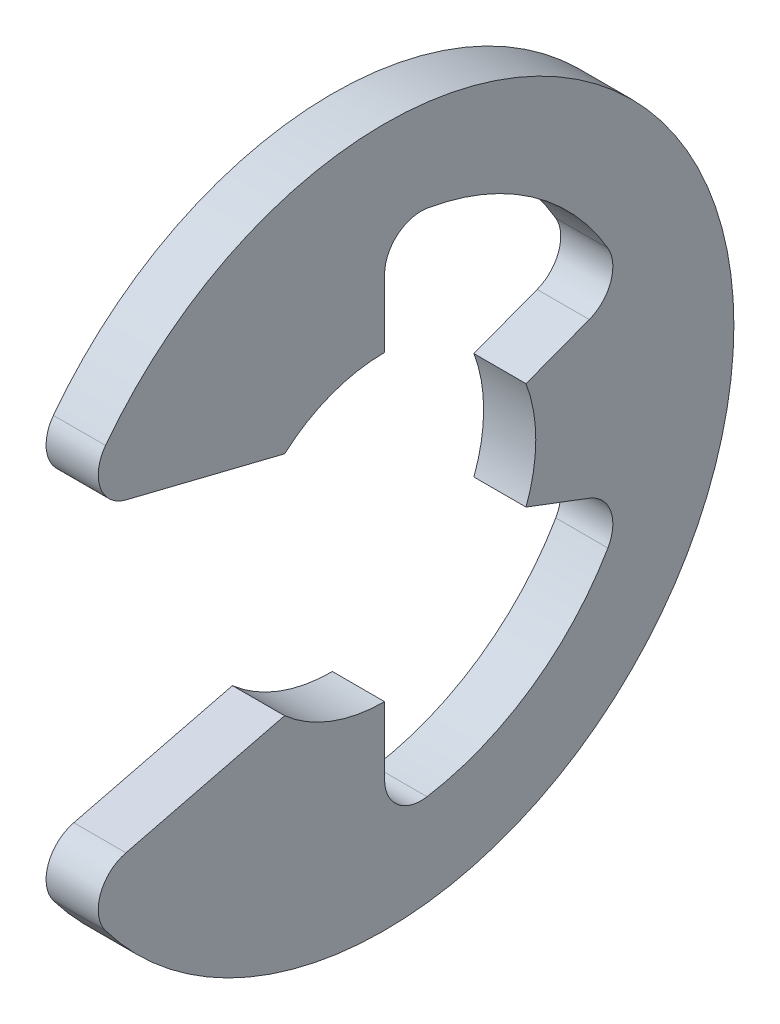
ISO-10303-21;
HEADER;
FILE_DESCRIPTION(('STEP AP214'),'2;1');
FILE_NAME('part.step','',(''),(''),'','','');
FILE_SCHEMA(('AUTOMOTIVE_DESIGN { 1 0 10303 214 1 1 1 1 }'));
ENDSEC;
DATA;
#1=APPLICATION_CONTEXT('core data for automotive mechanical design processes');
#2=APPLICATION_PROTOCOL_DEFINITION('international standard','automotive_design',2000,#1);
#3=PRODUCT_CONTEXT('',#1,'mechanical');
#4=PRODUCT('Part','Part','',(#3));
#5=PRODUCT_RELATED_PRODUCT_CATEGORY('part','',(#4));
#6=PRODUCT_DEFINITION_FORMATION('','',#4);
#7=PRODUCT_DEFINITION_CONTEXT('part definition',#1,'design');
#8=PRODUCT_DEFINITION('design','',#6,#7);
#9=PRODUCT_DEFINITION_SHAPE('','',#8);
#10=(LENGTH_UNIT() NAMED_UNIT(*) SI_UNIT(.MILLI.,.METRE.));
#11=(NAMED_UNIT(*) PLANE_ANGLE_UNIT() SI_UNIT($,.RADIAN.));
#12=(NAMED_UNIT(*) SI_UNIT($,.STERADIAN.) SOLID_ANGLE_UNIT());
#13=UNCERTAINTY_MEASURE_WITH_UNIT(LENGTH_MEASURE(1.E-05),#10,'distance_accuracy_value','');
#14=(GEOMETRIC_REPRESENTATION_CONTEXT(3) GLOBAL_UNCERTAINTY_ASSIGNED_CONTEXT((#13)) GLOBAL_UNIT_ASSIGNED_CONTEXT((#10,
#11,#12)) REPRESENTATION_CONTEXT('',''));
#15=CARTESIAN_POINT('',(0.,0.,0.));
#16=DIRECTION('',(0.,0.,1.));
#17=DIRECTION('',(1.,0.,0.));
#18=AXIS2_PLACEMENT_3D('',#15,#16,#17);
#19=CARTESIAN_POINT('',(0.3175,0.,0.));
#20=DIRECTION('',(-1.,0.,0.));
#21=DIRECTION('',(0.,0.,1.));
#22=AXIS2_PLACEMENT_3D('',#19,#20,#21);
#23=CYLINDRICAL_SURFACE('',#22,4.2545);
#24=CARTESIAN_POINT('',(0.3175,0.,0.));
#25=DIRECTION('',(1.,0.,0.));
#26=DIRECTION('',(0.,0.,-1.));
#27=AXIS2_PLACEMENT_3D('',#24,#25,#26);
#28=CIRCLE('',#27,4.2545);
#29=CARTESIAN_POINT('',(0.3175,-2.55970079348508,3.39833813765374));
#30=VERTEX_POINT('',#29);
#31=CARTESIAN_POINT('',(0.3175,2.55970079348508,3.39833813765374));
#32=VERTEX_POINT('',#31);
#33=EDGE_CURVE('E170',#30,#32,#28,.T.);
#34=ORIENTED_EDGE('',*,*,#33,.F.);
#35=DIRECTION('',(-1.,0.,0.));
#36=VECTOR('',#35,1.);
#37=CARTESIAN_POINT('',(0.3175,-2.55970079348508,3.39833813765374));
#38=LINE('',#37,#36);
#39=CARTESIAN_POINT('',(-0.3175,-2.55970079348508,3.39833813765374));
#40=VERTEX_POINT('',#39);
#41=EDGE_CURVE('E264',#30,#40,#38,.T.);
#42=ORIENTED_EDGE('',*,*,#41,.T.);
#43=CARTESIAN_POINT('',(-0.3175,0.,0.));
#44=DIRECTION('',(1.,0.,0.));
#45=DIRECTION('',(0.,0.,-1.));
#46=AXIS2_PLACEMENT_3D('',#43,#44,#45);
#47=CIRCLE('',#46,4.2545);
#48=CARTESIAN_POINT('',(-0.3175,2.55970079348508,3.39833813765374));
#49=VERTEX_POINT('',#48);
#50=EDGE_CURVE('E208',#40,#49,#47,.T.);
#51=ORIENTED_EDGE('',*,*,#50,.T.);
#52=DIRECTION('',(-1.,0.,0.));
#53=VECTOR('',#52,1.);
#54=CARTESIAN_POINT('',(0.3175,2.55970079348508,3.39833813765374));
#55=LINE('',#54,#53);
#56=EDGE_CURVE('E262',#49,#32,#55,.F.);
#57=ORIENTED_EDGE('',*,*,#56,.T.);
#58=EDGE_LOOP('',(#34,#42,#51,#57));
#59=FACE_BOUND('',#58,.T.);
#60=ADVANCED_FACE('F32',(#59),#23,.T.);
#61=CARTESIAN_POINT('',(0.3175,2.00970746878701,3.74991281764013));
#62=DIRECTION('',(0.,0.970536829925373,-0.240952820606873));
#63=DIRECTION('',(0.,0.240952820606873,0.970536829925373));
#64=AXIS2_PLACEMENT_3D('',#61,#62,#63);
#65=PLANE('',#64);
#66=DIRECTION('',(0.,-0.240952820606873,-0.970536829925373));
#67=VECTOR('',#66,1.);
#68=CARTESIAN_POINT('',(0.3175,2.00970746878701,3.74991281764013));
#69=LINE('',#68,#67);
#70=CARTESIAN_POINT('',(0.3175,1.86086574639824,3.15039141322579));
#71=VERTEX_POINT('',#70);
#72=CARTESIAN_POINT('',(0.3175,1.381125,1.21803775983136));
#73=VERTEX_POINT('',#72);
#74=EDGE_CURVE('E156',#71,#73,#69,.T.);
#75=ORIENTED_EDGE('',*,*,#74,.F.);
#76=DIRECTION('',(-1.,0.,0.));
#77=VECTOR('',#76,1.);
#78=CARTESIAN_POINT('',(0.3175,1.86086574639824,3.15039141322579));
#79=LINE('',#78,#77);
#80=CARTESIAN_POINT('',(-0.3175,1.86086574639824,3.15039141322579));
#81=VERTEX_POINT('',#80);
#82=EDGE_CURVE('E276',#71,#81,#79,.T.);
#83=ORIENTED_EDGE('',*,*,#82,.T.);
#84=DIRECTION('',(0.,-0.240952820606873,-0.970536829925373));
#85=VECTOR('',#84,1.);
#86=CARTESIAN_POINT('',(-0.3175,2.00970746878701,3.74991281764013));
#87=LINE('',#86,#85);
#88=CARTESIAN_POINT('',(-0.3175,1.381125,1.21803775983136));
#89=VERTEX_POINT('',#88);
#90=EDGE_CURVE('E176',#81,#89,#87,.T.);
#91=ORIENTED_EDGE('',*,*,#90,.T.);
#92=DIRECTION('',(-1.,0.,0.));
#93=VECTOR('',#92,1.);
#94=CARTESIAN_POINT('',(0.3175,1.381125,1.21803775983136));
#95=LINE('',#94,#93);
#96=EDGE_CURVE('E173',#73,#89,#95,.T.);
#97=ORIENTED_EDGE('',*,*,#96,.F.);
#98=EDGE_LOOP('',(#75,#83,#91,#97));
#99=FACE_BOUND('',#98,.T.);
#100=ADVANCED_FACE('F174',(#99),#65,.F.);
#101=CARTESIAN_POINT('',(0.3175,0.,0.));
#102=DIRECTION('',(-1.,0.,0.));
#103=DIRECTION('',(0.,0.,1.));
#104=AXIS2_PLACEMENT_3D('',#101,#102,#103);
#105=CYLINDRICAL_SURFACE('',#104,1.8415);
#106=CARTESIAN_POINT('',(-0.3175,0.,0.));
#107=DIRECTION('',(-1.,0.,0.));
#108=DIRECTION('',(0.,0.,1.));
#109=AXIS2_PLACEMENT_3D('',#106,#107,#108);
#110=CIRCLE('',#109,1.8415);
#111=CARTESIAN_POINT('',(-0.3175,1.8415,0.));
#112=VERTEX_POINT('',#111);
#113=EDGE_CURVE('E212',#89,#112,#110,.T.);
#114=ORIENTED_EDGE('',*,*,#113,.T.);
#115=DIRECTION('',(-1.,0.,0.));
#116=VECTOR('',#115,1.);
#117=CARTESIAN_POINT('',(0.3175,1.8415,0.));
#118=LINE('',#117,#116);
#119=CARTESIAN_POINT('',(0.3175,1.8415,0.));
#120=VERTEX_POINT('',#119);
#121=EDGE_CURVE('E180',#120,#112,#118,.T.);
#122=ORIENTED_EDGE('',*,*,#121,.F.);
#123=CARTESIAN_POINT('',(0.3175,0.,0.));
#124=DIRECTION('',(-1.,0.,0.));
#125=DIRECTION('',(0.,0.,1.));
#126=AXIS2_PLACEMENT_3D('',#123,#124,#125);
#127=CIRCLE('',#126,1.8415);
#128=EDGE_CURVE('E162',#73,#120,#127,.T.);
#129=ORIENTED_EDGE('',*,*,#128,.F.);
#130=ORIENTED_EDGE('',*,*,#96,.T.);
#131=EDGE_LOOP('',(#114,#122,#129,#130));
#132=FACE_BOUND('',#131,.T.);
#133=ADVANCED_FACE('F182',(#132),#105,.F.);
#134=CARTESIAN_POINT('',(0.3175,1.8415,0.));
#135=DIRECTION('',(0.,0.,1.));
#136=DIRECTION('',(0.,-1.,0.));
#137=AXIS2_PLACEMENT_3D('',#134,#135,#136);
#138=PLANE('',#137);
#139=DIRECTION('',(0.,1.,0.));
#140=VECTOR('',#139,1.);
#141=CARTESIAN_POINT('',(-0.3175,1.8415,0.));
#142=LINE('',#141,#140);
#143=CARTESIAN_POINT('',(-0.3175,2.66500750604648,0.));
#144=VERTEX_POINT('',#143);
#145=EDGE_CURVE('E214',#112,#144,#142,.T.);
#146=ORIENTED_EDGE('',*,*,#145,.T.);
#147=DIRECTION('',(1.,0.,0.));
#148=VECTOR('',#147,1.);
#149=CARTESIAN_POINT('',(0.3175,2.66500750604648,0.));
#150=LINE('',#149,#148);
#151=CARTESIAN_POINT('',(0.3175,2.66500750604648,0.));
#152=VERTEX_POINT('',#151);
#153=EDGE_CURVE('E260',#144,#152,#150,.T.);
#154=ORIENTED_EDGE('',*,*,#153,.T.);
#155=DIRECTION('',(0.,1.,0.));
#156=VECTOR('',#155,1.);
#157=CARTESIAN_POINT('',(0.3175,1.8415,0.));
#158=LINE('',#157,#156);
#159=EDGE_CURVE('E185',#120,#152,#158,.T.);
#160=ORIENTED_EDGE('',*,*,#159,.F.);
#161=ORIENTED_EDGE('',*,*,#121,.T.);
#162=EDGE_LOOP('',(#146,#154,#160,#161));
#163=FACE_BOUND('',#162,.T.);
#164=ADVANCED_FACE('F382',(#163),#138,.F.);
#165=CARTESIAN_POINT('',(0.3175,0.,0.));
#166=DIRECTION('',(-1.,0.,0.));
#167=DIRECTION('',(0.,0.,1.));
#168=AXIS2_PLACEMENT_3D('',#165,#166,#167);
#169=CYLINDRICAL_SURFACE('',#168,3.14632258064516);
#170=CARTESIAN_POINT('',(0.3175,0.,0.));
#171=DIRECTION('',(-1.,0.,0.));
#172=DIRECTION('',(0.,0.,-1.));
#173=AXIS2_PLACEMENT_3D('',#170,#171,#172);
#174=CIRCLE('',#173,3.14632258064516);
#175=CARTESIAN_POINT('',(0.3175,3.10345074244685,-0.517628506444275));
#176=VERTEX_POINT('',#175);
#177=CARTESIAN_POINT('',(0.3175,1.58143266371679,-2.72000303522022));
#178=VERTEX_POINT('',#177);
#179=EDGE_CURVE('E187',#176,#178,#174,.T.);
#180=ORIENTED_EDGE('',*,*,#179,.F.);
#181=DIRECTION('',(-1.,0.,0.));
#182=VECTOR('',#181,1.);
#183=CARTESIAN_POINT('',(0.3175,3.10345074244685,-0.517628506444275));
#184=LINE('',#183,#182);
#185=CARTESIAN_POINT('',(-0.3175,3.10345074244685,-0.517628506444275));
#186=VERTEX_POINT('',#185);
#187=EDGE_CURVE('E257',#176,#186,#184,.T.);
#188=ORIENTED_EDGE('',*,*,#187,.T.);
#189=CARTESIAN_POINT('',(-0.3175,0.,0.));
#190=DIRECTION('',(-1.,0.,0.));
#191=DIRECTION('',(0.,0.,-1.));
#192=AXIS2_PLACEMENT_3D('',#189,#190,#191);
#193=CIRCLE('',#192,3.14632258064516);
#194=CARTESIAN_POINT('',(-0.3175,1.58143266371679,-2.72000303522022));
#195=VERTEX_POINT('',#194);
#196=EDGE_CURVE('E217',#186,#195,#193,.T.);
#197=ORIENTED_EDGE('',*,*,#196,.T.);
#198=DIRECTION('',(-1.,0.,0.));
#199=VECTOR('',#198,1.);
#200=CARTESIAN_POINT('',(0.3175,1.58143266371679,-2.72000303522023));
#201=LINE('',#200,#199);
#202=EDGE_CURVE('E255',#195,#178,#201,.F.);
#203=ORIENTED_EDGE('',*,*,#202,.T.);
#204=EDGE_LOOP('',(#180,#188,#197,#203));
#205=FACE_BOUND('',#204,.T.);
#206=ADVANCED_FACE('F304',(#205),#169,.F.);
#207=CARTESIAN_POINT('',(0.3175,0.651068568777514,-1.72256551943605));
#208=DIRECTION('',(0.,-0.935414346693485,-0.353553390593274));
#209=DIRECTION('',(0.,0.353553390593274,-0.935414346693485));
#210=AXIS2_PLACEMENT_3D('',#207,#208,#209);
#211=PLANE('',#210);
#212=DIRECTION('',(0.,-0.353553390593274,0.935414346693485));
#213=VECTOR('',#212,1.);
#214=CARTESIAN_POINT('',(0.3175,0.651068568777514,-1.72256551943605));
#215=LINE('',#214,#213);
#216=CARTESIAN_POINT('',(0.3175,0.942222439719258,-2.4928862552017));
#217=VERTEX_POINT('',#216);
#218=CARTESIAN_POINT('',(0.3175,0.651068568777514,-1.72256551943605));
#219=VERTEX_POINT('',#218);
#220=EDGE_CURVE('E192',#217,#219,#215,.T.);
#221=ORIENTED_EDGE('',*,*,#220,.F.);
#222=DIRECTION('',(1.,0.,0.));
#223=VECTOR('',#222,1.);
#224=CARTESIAN_POINT('',(-0.3175,0.942222439719258,-2.4928862552017));
#225=LINE('',#224,#223);
#226=CARTESIAN_POINT('',(-0.3175,0.942222439719258,-2.4928862552017));
#227=VERTEX_POINT('',#226);
#228=EDGE_CURVE('E279',#217,#227,#225,.F.);
#229=ORIENTED_EDGE('',*,*,#228,.T.);
#230=DIRECTION('',(0.,-0.353553390593274,0.935414346693485));
#231=VECTOR('',#230,1.);
#232=CARTESIAN_POINT('',(-0.3175,0.651068568777514,-1.72256551943605));
#233=LINE('',#232,#231);
#234=CARTESIAN_POINT('',(-0.3175,0.651068568777514,-1.72256551943605));
#235=VERTEX_POINT('',#234);
#236=EDGE_CURVE('E220',#227,#235,#233,.T.);
#237=ORIENTED_EDGE('',*,*,#236,.T.);
#238=DIRECTION('',(-1.,0.,0.));
#239=VECTOR('',#238,1.);
#240=CARTESIAN_POINT('',(0.3175,0.651068568777514,-1.72256551943605));
#241=LINE('',#240,#239);
#242=EDGE_CURVE('E244',#219,#235,#241,.T.);
#243=ORIENTED_EDGE('',*,*,#242,.F.);
#244=EDGE_LOOP('',(#221,#229,#237,#243));
#245=FACE_BOUND('',#244,.T.);
#246=ADVANCED_FACE('F307',(#245),#211,.F.);
#247=CARTESIAN_POINT('',(0.3175,0.,0.));
#248=DIRECTION('',(-1.,0.,0.));
#249=DIRECTION('',(0.,0.,1.));
#250=AXIS2_PLACEMENT_3D('',#247,#248,#249);
#251=CYLINDRICAL_SURFACE('',#250,1.8415);
#252=CARTESIAN_POINT('',(-0.3175,0.,0.));
#253=DIRECTION('',(-1.,0.,0.));
#254=DIRECTION('',(0.,0.,1.));
#255=AXIS2_PLACEMENT_3D('',#252,#253,#254);
#256=CIRCLE('',#255,1.8415);
#257=CARTESIAN_POINT('',(-0.3175,-0.651068568777513,-1.72256551943605));
#258=VERTEX_POINT('',#257);
#259=EDGE_CURVE('E222',#235,#258,#256,.T.);
#260=ORIENTED_EDGE('',*,*,#259,.T.);
#261=DIRECTION('',(-1.,0.,0.));
#262=VECTOR('',#261,1.);
#263=CARTESIAN_POINT('',(0.3175,-0.651068568777513,-1.72256551943605));
#264=LINE('',#263,#262);
#265=CARTESIAN_POINT('',(0.3175,-0.651068568777513,-1.72256551943605));
#266=VERTEX_POINT('',#265);
#267=EDGE_CURVE('E241',#266,#258,#264,.T.);
#268=ORIENTED_EDGE('',*,*,#267,.F.);
#269=CARTESIAN_POINT('',(0.3175,0.,0.));
#270=DIRECTION('',(-1.,0.,0.));
#271=DIRECTION('',(0.,0.,1.));
#272=AXIS2_PLACEMENT_3D('',#269,#270,#271);
#273=CIRCLE('',#272,1.8415);
#274=EDGE_CURVE('E194',#219,#266,#273,.T.);
#275=ORIENTED_EDGE('',*,*,#274,.F.);
#276=ORIENTED_EDGE('',*,*,#242,.T.);
#277=EDGE_LOOP('',(#260,#268,#275,#276));
#278=FACE_BOUND('',#277,.T.);
#279=ADVANCED_FACE('F313',(#278),#251,.F.);
#280=CARTESIAN_POINT('',(0.3175,-0.651068568777513,-1.72256551943605));
#281=DIRECTION('',(0.,0.935414346693485,-0.353553390593274));
#282=DIRECTION('',(0.,0.353553390593274,0.935414346693485));
#283=AXIS2_PLACEMENT_3D('',#280,#281,#282);
#284=PLANE('',#283);
#285=DIRECTION('',(0.,-0.353553390593274,-0.935414346693485));
#286=VECTOR('',#285,1.);
#287=CARTESIAN_POINT('',(-0.3175,-0.651068568777513,-1.72256551943605));
#288=LINE('',#287,#286);
#289=CARTESIAN_POINT('',(-0.3175,-0.942222439719257,-2.4928862552017));
#290=VERTEX_POINT('',#289);
#291=EDGE_CURVE('E224',#258,#290,#288,.T.);
#292=ORIENTED_EDGE('',*,*,#291,.T.);
#293=DIRECTION('',(1.,0.,0.));
#294=VECTOR('',#293,1.);
#295=CARTESIAN_POINT('',(0.3175,-0.942222439719257,-2.4928862552017));
#296=LINE('',#295,#294);
#297=CARTESIAN_POINT('',(0.3175,-0.942222439719257,-2.4928862552017));
#298=VERTEX_POINT('',#297);
#299=EDGE_CURVE('E47',#290,#298,#296,.T.);
#300=ORIENTED_EDGE('',*,*,#299,.T.);
#301=DIRECTION('',(0.,-0.353553390593274,-0.935414346693485));
#302=VECTOR('',#301,1.);
#303=CARTESIAN_POINT('',(0.3175,-0.651068568777513,-1.72256551943605));
#304=LINE('',#303,#302);
#305=EDGE_CURVE('E196',#266,#298,#304,.T.);
#306=ORIENTED_EDGE('',*,*,#305,.F.);
#307=ORIENTED_EDGE('',*,*,#267,.T.);
#308=EDGE_LOOP('',(#292,#300,#306,#307));
#309=FACE_BOUND('',#308,.T.);
#310=ADVANCED_FACE('F315',(#309),#284,.F.);
#311=CARTESIAN_POINT('',(0.3175,0.,0.));
#312=DIRECTION('',(-1.,0.,0.));
#313=DIRECTION('',(0.,0.,1.));
#314=AXIS2_PLACEMENT_3D('',#311,#312,#313);
#315=CYLINDRICAL_SURFACE('',#314,3.14632258064516);
#316=CARTESIAN_POINT('',(-0.3175,0.,0.));
#317=DIRECTION('',(-1.,0.,0.));
#318=DIRECTION('',(0.,0.,-1.));
#319=AXIS2_PLACEMENT_3D('',#316,#317,#318);
#320=CIRCLE('',#319,3.14632258064516);
#321=CARTESIAN_POINT('',(-0.3175,-1.58143266371679,-2.72000303522023));
#322=VERTEX_POINT('',#321);
#323=CARTESIAN_POINT('',(-0.3175,-3.10345074244685,-0.517628506444276));
#324=VERTEX_POINT('',#323);
#325=EDGE_CURVE('E226',#322,#324,#320,.T.);
#326=ORIENTED_EDGE('',*,*,#325,.T.);
#327=DIRECTION('',(-1.,0.,0.));
#328=VECTOR('',#327,1.);
#329=CARTESIAN_POINT('',(0.3175,-3.10345074244685,-0.517628506444276));
#330=LINE('',#329,#328);
#331=CARTESIAN_POINT('',(0.3175,-3.10345074244685,-0.517628506444276));
#332=VERTEX_POINT('',#331);
#333=EDGE_CURVE('E253',#324,#332,#330,.F.);
#334=ORIENTED_EDGE('',*,*,#333,.T.);
#335=CARTESIAN_POINT('',(0.3175,0.,0.));
#336=DIRECTION('',(-1.,0.,0.));
#337=DIRECTION('',(0.,0.,-1.));
#338=AXIS2_PLACEMENT_3D('',#335,#336,#337);
#339=CIRCLE('',#338,3.14632258064516);
#340=CARTESIAN_POINT('',(0.3175,-1.58143266371679,-2.72000303522023));
#341=VERTEX_POINT('',#340);
#342=EDGE_CURVE('E198',#341,#332,#339,.T.);
#343=ORIENTED_EDGE('',*,*,#342,.F.);
#344=DIRECTION('',(-1.,0.,0.));
#345=VECTOR('',#344,1.);
#346=CARTESIAN_POINT('',(0.3175,-1.58143266371679,-2.72000303522023));
#347=LINE('',#346,#345);
#348=EDGE_CURVE('E250',#341,#322,#347,.T.);
#349=ORIENTED_EDGE('',*,*,#348,.T.);
#350=EDGE_LOOP('',(#326,#334,#343,#349));
#351=FACE_BOUND('',#350,.T.);
#352=ADVANCED_FACE('F317',(#351),#315,.F.);
#353=CARTESIAN_POINT('',(0.3175,-1.8415,0.));
#354=DIRECTION('',(0.,0.,1.));
#355=DIRECTION('',(0.,-1.,0.));
#356=AXIS2_PLACEMENT_3D('',#353,#354,#355);
#357=PLANE('',#356);
#358=DIRECTION('',(0.,1.,0.));
#359=VECTOR('',#358,1.);
#360=CARTESIAN_POINT('',(0.3175,-1.8415,0.));
#361=LINE('',#360,#359);
#362=CARTESIAN_POINT('',(0.3175,-2.66500750604648,0.));
#363=VERTEX_POINT('',#362);
#364=CARTESIAN_POINT('',(0.3175,-1.8415,0.));
#365=VERTEX_POINT('',#364);
#366=EDGE_CURVE('E201',#363,#365,#361,.T.);
#367=ORIENTED_EDGE('',*,*,#366,.F.);
#368=DIRECTION('',(1.,0.,0.));
#369=VECTOR('',#368,1.);
#370=CARTESIAN_POINT('',(-0.3175,-2.66500750604648,0.));
#371=LINE('',#370,#369);
#372=CARTESIAN_POINT('',(-0.3175,-2.66500750604648,0.));
#373=VERTEX_POINT('',#372);
#374=EDGE_CURVE('E179',#363,#373,#371,.F.);
#375=ORIENTED_EDGE('',*,*,#374,.T.);
#376=DIRECTION('',(0.,1.,0.));
#377=VECTOR('',#376,1.);
#378=CARTESIAN_POINT('',(-0.3175,-1.8415,0.));
#379=LINE('',#378,#377);
#380=CARTESIAN_POINT('',(-0.3175,-1.8415,0.));
#381=VERTEX_POINT('',#380);
#382=EDGE_CURVE('E229',#373,#381,#379,.T.);
#383=ORIENTED_EDGE('',*,*,#382,.T.);
#384=DIRECTION('',(-1.,0.,0.));
#385=VECTOR('',#384,1.);
#386=CARTESIAN_POINT('',(0.3175,-1.8415,0.));
#387=LINE('',#386,#385);
#388=EDGE_CURVE('E238',#365,#381,#387,.T.);
#389=ORIENTED_EDGE('',*,*,#388,.F.);
#390=EDGE_LOOP('',(#367,#375,#383,#389));
#391=FACE_BOUND('',#390,.T.);
#392=ADVANCED_FACE('F323',(#391),#357,.F.);
#393=CARTESIAN_POINT('',(0.3175,0.,0.));
#394=DIRECTION('',(-1.,0.,0.));
#395=DIRECTION('',(0.,0.,1.));
#396=AXIS2_PLACEMENT_3D('',#393,#394,#395);
#397=CYLINDRICAL_SURFACE('',#396,1.8415);
#398=CARTESIAN_POINT('',(-0.3175,0.,0.));
#399=DIRECTION('',(-1.,0.,0.));
#400=DIRECTION('',(0.,0.,-1.));
#401=AXIS2_PLACEMENT_3D('',#398,#399,#400);
#402=CIRCLE('',#401,1.8415);
#403=CARTESIAN_POINT('',(-0.3175,-1.381125,1.21803775983136));
#404=VERTEX_POINT('',#403);
#405=EDGE_CURVE('E231',#381,#404,#402,.T.);
#406=ORIENTED_EDGE('',*,*,#405,.T.);
#407=DIRECTION('',(-1.,0.,0.));
#408=VECTOR('',#407,1.);
#409=CARTESIAN_POINT('',(0.3175,-1.381125,1.21803775983136));
#410=LINE('',#409,#408);
#411=CARTESIAN_POINT('',(0.3175,-1.381125,1.21803775983136));
#412=VERTEX_POINT('',#411);
#413=EDGE_CURVE('E207',#412,#404,#410,.T.);
#414=ORIENTED_EDGE('',*,*,#413,.F.);
#415=CARTESIAN_POINT('',(0.3175,0.,0.));
#416=DIRECTION('',(-1.,0.,0.));
#417=DIRECTION('',(0.,0.,-1.));
#418=AXIS2_PLACEMENT_3D('',#415,#416,#417);
#419=CIRCLE('',#418,1.8415);
#420=EDGE_CURVE('E203',#365,#412,#419,.T.);
#421=ORIENTED_EDGE('',*,*,#420,.F.);
#422=ORIENTED_EDGE('',*,*,#388,.T.);
#423=EDGE_LOOP('',(#406,#414,#421,#422));
#424=FACE_BOUND('',#423,.T.);
#425=ADVANCED_FACE('F372',(#424),#397,.F.);
#426=CARTESIAN_POINT('',(0.3175,-2.00970746878701,3.74991281764013));
#427=DIRECTION('',(0.,-0.970536829925373,-0.240952820606873));
#428=DIRECTION('',(0.,0.240952820606873,-0.970536829925373));
#429=AXIS2_PLACEMENT_3D('',#426,#427,#428);
#430=PLANE('',#429);
#431=DIRECTION('',(0.,-0.240952820606873,0.970536829925373));
#432=VECTOR('',#431,1.);
#433=CARTESIAN_POINT('',(-0.3175,-2.00970746878701,3.74991281764013));
#434=LINE('',#433,#432);
#435=CARTESIAN_POINT('',(-0.3175,-1.86086574639824,3.15039141322579));
#436=VERTEX_POINT('',#435);
#437=EDGE_CURVE('E233',#404,#436,#434,.T.);
#438=ORIENTED_EDGE('',*,*,#437,.T.);
#439=DIRECTION('',(-1.,0.,0.));
#440=VECTOR('',#439,1.);
#441=CARTESIAN_POINT('',(0.3175,-1.86086574639824,3.15039141322579));
#442=LINE('',#441,#440);
#443=CARTESIAN_POINT('',(0.3175,-1.86086574639824,3.15039141322579));
#444=VERTEX_POINT('',#443);
#445=EDGE_CURVE('E271',#436,#444,#442,.F.);
#446=ORIENTED_EDGE('',*,*,#445,.T.);
#447=DIRECTION('',(0.,-0.240952820606873,0.970536829925373));
#448=VECTOR('',#447,1.);
#449=CARTESIAN_POINT('',(0.3175,-2.00970746878701,3.74991281764013));
#450=LINE('',#449,#448);
#451=EDGE_CURVE('E205',#412,#444,#450,.T.);
#452=ORIENTED_EDGE('',*,*,#451,.F.);
#453=ORIENTED_EDGE('',*,*,#413,.T.);
#454=EDGE_LOOP('',(#438,#446,#452,#453));
#455=FACE_BOUND('',#454,.T.);
#456=ADVANCED_FACE('F414',(#455),#430,.F.);
#457=CARTESIAN_POINT('',(0.3175,0.,0.));
#458=DIRECTION('',(1.,0.,0.));
#459=DIRECTION('',(0.,0.,-1.));
#460=AXIS2_PLACEMENT_3D('',#457,#458,#459);
#461=PLANE('',#460);
#462=ORIENTED_EDGE('',*,*,#451,.T.);
#463=CARTESIAN_POINT('',(0.3175,-2.29226936730007,3.04328788446603));
#464=DIRECTION('',(1.,0.,0.));
#465=DIRECTION('',(0.,0.,-1.));
#466=AXIS2_PLACEMENT_3D('',#463,#464,#465);
#467=CIRCLE('',#466,0.4445);
#468=EDGE_CURVE('E274',#444,#30,#467,.T.);
#469=ORIENTED_EDGE('',*,*,#468,.T.);
#470=ORIENTED_EDGE('',*,*,#33,.T.);
#471=CARTESIAN_POINT('',(0.3175,2.29226936730007,3.04328788446603));
#472=DIRECTION('',(1.,0.,0.));
#473=DIRECTION('',(0.,0.,-1.));
#474=AXIS2_PLACEMENT_3D('',#471,#472,#473);
#475=CIRCLE('',#474,0.4445);
#476=EDGE_CURVE('E166',#32,#71,#475,.T.);
#477=ORIENTED_EDGE('',*,*,#476,.T.);
#478=ORIENTED_EDGE('',*,*,#74,.T.);
#479=ORIENTED_EDGE('',*,*,#128,.T.);
#480=ORIENTED_EDGE('',*,*,#159,.T.);
#481=CARTESIAN_POINT('',(0.3175,2.66500750604648,-0.444499999999999));
#482=DIRECTION('',(1.,0.,0.));
#483=DIRECTION('',(0.,0.,-1.));
#484=AXIS2_PLACEMENT_3D('',#481,#482,#483);
#485=CIRCLE('',#484,0.4445);
#486=EDGE_CURVE('E288',#152,#176,#485,.F.);
#487=ORIENTED_EDGE('',*,*,#486,.T.);
#488=ORIENTED_EDGE('',*,*,#179,.T.);
#489=CARTESIAN_POINT('',(0.3175,1.35801411682451,-2.33573177308299));
#490=DIRECTION('',(1.,0.,0.));
#491=DIRECTION('',(0.,0.,-1.));
#492=AXIS2_PLACEMENT_3D('',#489,#490,#491);
#493=CIRCLE('',#492,0.4445);
#494=EDGE_CURVE('E11',#178,#217,#493,.F.);
#495=ORIENTED_EDGE('',*,*,#494,.T.);
#496=ORIENTED_EDGE('',*,*,#220,.T.);
#497=ORIENTED_EDGE('',*,*,#274,.T.);
#498=ORIENTED_EDGE('',*,*,#305,.T.);
#499=CARTESIAN_POINT('',(0.3175,-1.35801411682451,-2.33573177308299));
#500=DIRECTION('',(1.,0.,0.));
#501=DIRECTION('',(0.,0.,-1.));
#502=AXIS2_PLACEMENT_3D('',#499,#500,#501);
#503=CIRCLE('',#502,0.4445);
#504=EDGE_CURVE('E292',#298,#341,#503,.F.);
#505=ORIENTED_EDGE('',*,*,#504,.T.);
#506=ORIENTED_EDGE('',*,*,#342,.T.);
#507=CARTESIAN_POINT('',(0.3175,-2.66500750604648,-0.4445));
#508=DIRECTION('',(1.,0.,0.));
#509=DIRECTION('',(0.,0.,-1.));
#510=AXIS2_PLACEMENT_3D('',#507,#508,#509);
#511=CIRCLE('',#510,0.4445);
#512=EDGE_CURVE('E284',#332,#363,#511,.F.);
#513=ORIENTED_EDGE('',*,*,#512,.T.);
#514=ORIENTED_EDGE('',*,*,#366,.T.);
#515=ORIENTED_EDGE('',*,*,#420,.T.);
#516=EDGE_LOOP('',(#462,#469,#470,#477,#478,#479,#480,#487,#488,#495,#496,#497,#498,#505,#506,
#513,#514,#515));
#517=FACE_BOUND('',#516,.T.);
#518=ADVANCED_FACE('F159',(#517),#461,.T.);
#519=CARTESIAN_POINT('',(-0.3175,0.,0.));
#520=DIRECTION('',(1.,0.,0.));
#521=DIRECTION('',(0.,0.,-1.));
#522=AXIS2_PLACEMENT_3D('',#519,#520,#521);
#523=PLANE('',#522);
#524=ORIENTED_EDGE('',*,*,#50,.F.);
#525=CARTESIAN_POINT('',(-0.3175,-2.29226936730007,3.04328788446603));
#526=DIRECTION('',(1.,0.,0.));
#527=DIRECTION('',(0.,0.,-1.));
#528=AXIS2_PLACEMENT_3D('',#525,#526,#527);
#529=CIRCLE('',#528,0.4445);
#530=EDGE_CURVE('E269',#40,#436,#529,.F.);
#531=ORIENTED_EDGE('',*,*,#530,.T.);
#532=ORIENTED_EDGE('',*,*,#437,.F.);
#533=ORIENTED_EDGE('',*,*,#405,.F.);
#534=ORIENTED_EDGE('',*,*,#382,.F.);
#535=CARTESIAN_POINT('',(-0.3175,-2.66500750604648,-0.4445));
#536=DIRECTION('',(1.,0.,0.));
#537=DIRECTION('',(0.,0.,-1.));
#538=AXIS2_PLACEMENT_3D('',#535,#536,#537);
#539=CIRCLE('',#538,0.4445);
#540=EDGE_CURVE('E282',#373,#324,#539,.T.);
#541=ORIENTED_EDGE('',*,*,#540,.T.);
#542=ORIENTED_EDGE('',*,*,#325,.F.);
#543=CARTESIAN_POINT('',(-0.3175,-1.35801411682451,-2.33573177308299));
#544=DIRECTION('',(1.,0.,0.));
#545=DIRECTION('',(0.,0.,-1.));
#546=AXIS2_PLACEMENT_3D('',#543,#544,#545);
#547=CIRCLE('',#546,0.4445);
#548=EDGE_CURVE('E290',#322,#290,#547,.T.);
#549=ORIENTED_EDGE('',*,*,#548,.T.);
#550=ORIENTED_EDGE('',*,*,#291,.F.);
#551=ORIENTED_EDGE('',*,*,#259,.F.);
#552=ORIENTED_EDGE('',*,*,#236,.F.);
#553=CARTESIAN_POINT('',(-0.3175,1.35801411682451,-2.33573177308299));
#554=DIRECTION('',(1.,0.,0.));
#555=DIRECTION('',(0.,0.,-1.));
#556=AXIS2_PLACEMENT_3D('',#553,#554,#555);
#557=CIRCLE('',#556,0.4445);
#558=EDGE_CURVE('E40',#227,#195,#557,.T.);
#559=ORIENTED_EDGE('',*,*,#558,.T.);
#560=ORIENTED_EDGE('',*,*,#196,.F.);
#561=CARTESIAN_POINT('',(-0.3175,2.66500750604648,-0.444499999999999));
#562=DIRECTION('',(1.,0.,0.));
#563=DIRECTION('',(0.,0.,-1.));
#564=AXIS2_PLACEMENT_3D('',#561,#562,#563);
#565=CIRCLE('',#564,0.4445);
#566=EDGE_CURVE('E286',#186,#144,#565,.T.);
#567=ORIENTED_EDGE('',*,*,#566,.T.);
#568=ORIENTED_EDGE('',*,*,#145,.F.);
#569=ORIENTED_EDGE('',*,*,#113,.F.);
#570=ORIENTED_EDGE('',*,*,#90,.F.);
#571=CARTESIAN_POINT('',(-0.3175,2.29226936730007,3.04328788446603));
#572=DIRECTION('',(1.,0.,0.));
#573=DIRECTION('',(0.,0.,-1.));
#574=AXIS2_PLACEMENT_3D('',#571,#572,#573);
#575=CIRCLE('',#574,0.4445);
#576=EDGE_CURVE('E267',#81,#49,#575,.F.);
#577=ORIENTED_EDGE('',*,*,#576,.T.);
#578=EDGE_LOOP('',(#524,#531,#532,#533,#534,#541,#542,#549,#550,#551,#552,#559,#560,#567,#568,
#569,#570,#577));
#579=FACE_BOUND('',#578,.T.);
#580=ADVANCED_FACE('F297',(#579),#523,.F.);
#581=CARTESIAN_POINT('',(0.3175,-2.66500750604648,-0.4445));
#582=DIRECTION('',(-1.,0.,0.));
#583=DIRECTION('',(0.,0.,1.));
#584=AXIS2_PLACEMENT_3D('',#581,#582,#583);
#585=CYLINDRICAL_SURFACE('',#584,0.4445);
#586=ORIENTED_EDGE('',*,*,#512,.F.);
#587=ORIENTED_EDGE('',*,*,#333,.F.);
#588=ORIENTED_EDGE('',*,*,#540,.F.);
#589=ORIENTED_EDGE('',*,*,#374,.F.);
#590=EDGE_LOOP('',(#586,#587,#588,#589));
#591=FACE_BOUND('',#590,.T.);
#592=ADVANCED_FACE('F337',(#591),#585,.F.);
#593=CARTESIAN_POINT('',(0.3175,2.66500750604648,-0.444499999999999));
#594=DIRECTION('',(-1.,0.,0.));
#595=DIRECTION('',(0.,0.,1.));
#596=AXIS2_PLACEMENT_3D('',#593,#594,#595);
#597=CYLINDRICAL_SURFACE('',#596,0.4445);
#598=ORIENTED_EDGE('',*,*,#486,.F.);
#599=ORIENTED_EDGE('',*,*,#153,.F.);
#600=ORIENTED_EDGE('',*,*,#566,.F.);
#601=ORIENTED_EDGE('',*,*,#187,.F.);
#602=EDGE_LOOP('',(#598,#599,#600,#601));
#603=FACE_BOUND('',#602,.T.);
#604=ADVANCED_FACE('F340',(#603),#597,.F.);
#605=CARTESIAN_POINT('',(0.3175,-2.29226936730007,3.04328788446603));
#606=DIRECTION('',(-1.,0.,0.));
#607=DIRECTION('',(0.,0.,1.));
#608=AXIS2_PLACEMENT_3D('',#605,#606,#607);
#609=CYLINDRICAL_SURFACE('',#608,0.4445);
#610=ORIENTED_EDGE('',*,*,#468,.F.);
#611=ORIENTED_EDGE('',*,*,#445,.F.);
#612=ORIENTED_EDGE('',*,*,#530,.F.);
#613=ORIENTED_EDGE('',*,*,#41,.F.);
#614=EDGE_LOOP('',(#610,#611,#612,#613));
#615=FACE_BOUND('',#614,.T.);
#616=ADVANCED_FACE('F344',(#615),#609,.T.);
#617=CARTESIAN_POINT('',(0.3175,2.29226936730007,3.04328788446603));
#618=DIRECTION('',(-1.,0.,0.));
#619=DIRECTION('',(0.,0.,1.));
#620=AXIS2_PLACEMENT_3D('',#617,#618,#619);
#621=CYLINDRICAL_SURFACE('',#620,0.4445);
#622=ORIENTED_EDGE('',*,*,#476,.F.);
#623=ORIENTED_EDGE('',*,*,#56,.F.);
#624=ORIENTED_EDGE('',*,*,#576,.F.);
#625=ORIENTED_EDGE('',*,*,#82,.F.);
#626=EDGE_LOOP('',(#622,#623,#624,#625));
#627=FACE_BOUND('',#626,.T.);
#628=ADVANCED_FACE('F348',(#627),#621,.T.);
#629=CARTESIAN_POINT('',(0.3175,-1.35801411682451,-2.33573177308299));
#630=DIRECTION('',(-1.,0.,0.));
#631=DIRECTION('',(0.,0.,1.));
#632=AXIS2_PLACEMENT_3D('',#629,#630,#631);
#633=CYLINDRICAL_SURFACE('',#632,0.4445);
#634=ORIENTED_EDGE('',*,*,#504,.F.);
#635=ORIENTED_EDGE('',*,*,#299,.F.);
#636=ORIENTED_EDGE('',*,*,#548,.F.);
#637=ORIENTED_EDGE('',*,*,#348,.F.);
#638=EDGE_LOOP('',(#634,#635,#636,#637));
#639=FACE_BOUND('',#638,.T.);
#640=ADVANCED_FACE('F351',(#639),#633,.F.);
#641=CARTESIAN_POINT('',(0.3175,1.35801411682451,-2.33573177308299));
#642=DIRECTION('',(-1.,0.,0.));
#643=DIRECTION('',(0.,0.,1.));
#644=AXIS2_PLACEMENT_3D('',#641,#642,#643);
#645=CYLINDRICAL_SURFACE('',#644,0.4445);
#646=ORIENTED_EDGE('',*,*,#494,.F.);
#647=ORIENTED_EDGE('',*,*,#202,.F.);
#648=ORIENTED_EDGE('',*,*,#558,.F.);
#649=ORIENTED_EDGE('',*,*,#228,.F.);
#650=EDGE_LOOP('',(#646,#647,#648,#649));
#651=FACE_BOUND('',#650,.T.);
#652=ADVANCED_FACE('F34',(#651),#645,.F.);
#653=CLOSED_SHELL('',(#60,#100,#133,#164,#206,#246,#279,#310,#352,#392,#425,#456,#518,#580,#592,
#604,#616,#628,#640,#652));
#654=MANIFOLD_SOLID_BREP('B2',#653);
#655=ADVANCED_BREP_SHAPE_REPRESENTATION('',(#18,#654),#14);
#656=SHAPE_DEFINITION_REPRESENTATION(#9,#655);
ENDSEC;
END-ISO-10303-21;
